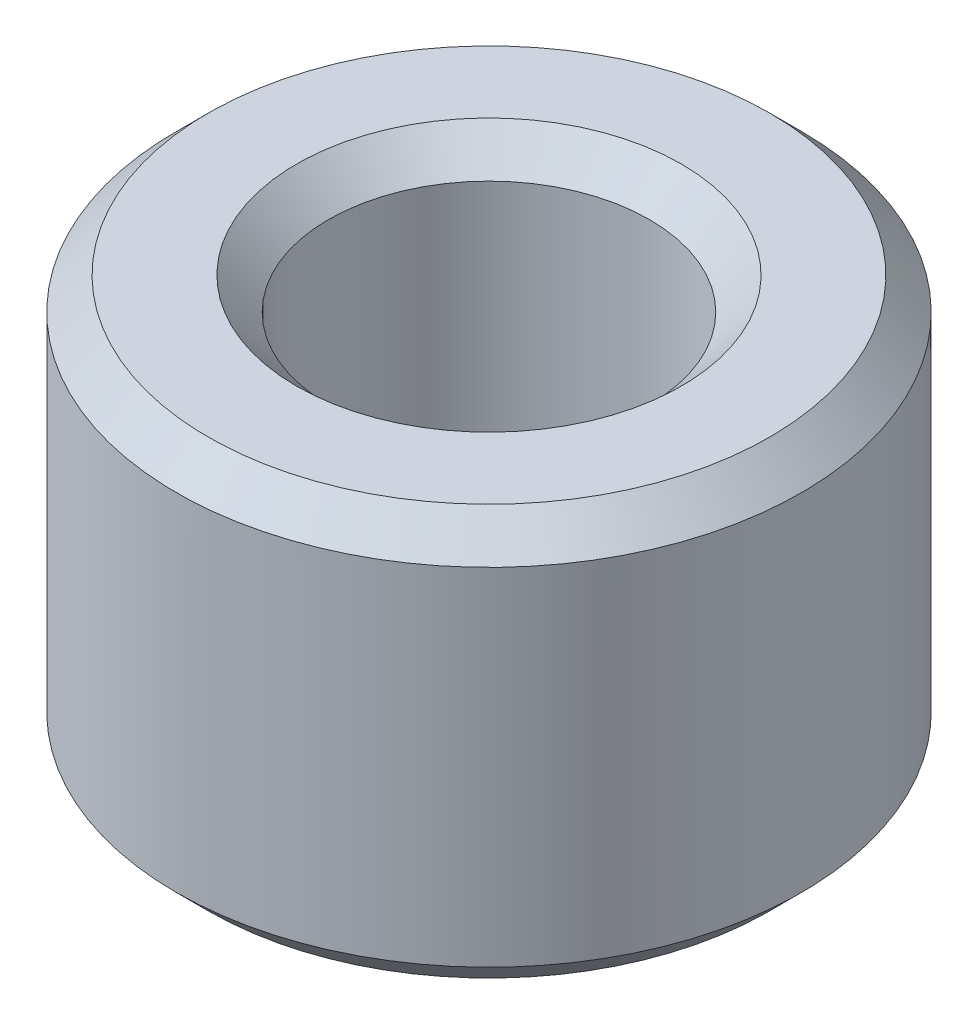
ISO-10303-21;
HEADER;
FILE_DESCRIPTION(('STEP AP214'),'2;1');
FILE_NAME('part.step','',(''),(''),'','','');
FILE_SCHEMA(('AUTOMOTIVE_DESIGN { 1 0 10303 214 1 1 1 1 }'));
ENDSEC;
DATA;
#1=APPLICATION_CONTEXT('core data for automotive mechanical design processes');
#2=APPLICATION_PROTOCOL_DEFINITION('international standard','automotive_design',2000,#1);
#3=PRODUCT_CONTEXT('',#1,'mechanical');
#4=PRODUCT('Part','Part','',(#3));
#5=PRODUCT_RELATED_PRODUCT_CATEGORY('part','',(#4));
#6=PRODUCT_DEFINITION_FORMATION('','',#4);
#7=PRODUCT_DEFINITION_CONTEXT('part definition',#1,'design');
#8=PRODUCT_DEFINITION('design','',#6,#7);
#9=PRODUCT_DEFINITION_SHAPE('','',#8);
#10=(LENGTH_UNIT() NAMED_UNIT(*) SI_UNIT(.MILLI.,.METRE.));
#11=(NAMED_UNIT(*) PLANE_ANGLE_UNIT() SI_UNIT($,.RADIAN.));
#12=(NAMED_UNIT(*) SI_UNIT($,.STERADIAN.) SOLID_ANGLE_UNIT());
#13=UNCERTAINTY_MEASURE_WITH_UNIT(LENGTH_MEASURE(1.E-05),#10,'distance_accuracy_value','');
#14=(GEOMETRIC_REPRESENTATION_CONTEXT(3) GLOBAL_UNCERTAINTY_ASSIGNED_CONTEXT((#13)) GLOBAL_UNIT_ASSIGNED_CONTEXT((#10,
#11,#12)) REPRESENTATION_CONTEXT('',''));
#15=CARTESIAN_POINT('',(0.,0.,0.));
#16=DIRECTION('',(0.,0.,1.));
#17=DIRECTION('',(1.,0.,0.));
#18=AXIS2_PLACEMENT_3D('',#15,#16,#17);
#19=CARTESIAN_POINT('',(0.,42.6467564029163,0.));
#20=DIRECTION('',(0.,-1.,0.));
#21=DIRECTION('',(0.,0.,-1.));
#22=AXIS2_PLACEMENT_3D('',#19,#20,#21);
#23=CYLINDRICAL_SURFACE('',#22,32.5);
#24=CARTESIAN_POINT('',(0.,3.3285684846602,0.));
#25=DIRECTION('',(0.,1.,0.));
#26=DIRECTION('',(0.,0.,1.));
#27=AXIS2_PLACEMENT_3D('',#24,#25,#26);
#28=CIRCLE('',#27,32.5);
#29=CARTESIAN_POINT('',(0.,3.3285684846602,32.5));
#30=VERTEX_POINT('',#29);
#31=EDGE_CURVE('E10',#30,#30,#28,.T.);
#32=ORIENTED_EDGE('',*,*,#31,.T.);
#33=EDGE_LOOP('',(#32));
#34=FACE_BOUND('',#33,.T.);
#35=CARTESIAN_POINT('',(0.,39.318187918256,0.));
#36=DIRECTION('',(0.,1.,0.));
#37=DIRECTION('',(0.,0.,1.));
#38=AXIS2_PLACEMENT_3D('',#35,#36,#37);
#39=CIRCLE('',#38,32.5);
#40=CARTESIAN_POINT('',(0.,39.318187918256,-32.5));
#41=VERTEX_POINT('',#40);
#42=EDGE_CURVE('E50',#41,#41,#39,.F.);
#43=ORIENTED_EDGE('',*,*,#42,.T.);
#44=EDGE_LOOP('',(#43));
#45=FACE_BOUND('',#44,.T.);
#46=ADVANCED_FACE('F39',(#34,#45),#23,.T.);
#47=CARTESIAN_POINT('',(0.,42.6467564029163,0.));
#48=DIRECTION('',(0.,1.,0.));
#49=DIRECTION('',(0.,0.,1.));
#50=AXIS2_PLACEMENT_3D('',#47,#48,#49);
#51=PLANE('',#50);
#52=CARTESIAN_POINT('',(0.,42.6467564029163,0.));
#53=DIRECTION('',(0.,1.,0.));
#54=DIRECTION('',(0.,0.,1.));
#55=AXIS2_PLACEMENT_3D('',#52,#53,#54);
#56=CIRCLE('',#55,19.9974460044769);
#57=CARTESIAN_POINT('',(0.,42.6467564029163,19.9974460044769));
#58=VERTEX_POINT('',#57);
#59=EDGE_CURVE('E58',#58,#58,#56,.F.);
#60=ORIENTED_EDGE('',*,*,#59,.T.);
#61=EDGE_LOOP('',(#60));
#62=FACE_BOUND('',#61,.T.);
#63=CARTESIAN_POINT('',(0.,42.6467564029163,0.));
#64=DIRECTION('',(0.,1.,0.));
#65=DIRECTION('',(0.,0.,1.));
#66=AXIS2_PLACEMENT_3D('',#63,#64,#65);
#67=CIRCLE('',#66,29.1714315153398);
#68=CARTESIAN_POINT('',(0.,42.6467564029163,-29.1714315153398));
#69=VERTEX_POINT('',#68);
#70=EDGE_CURVE('E61',#69,#69,#67,.T.);
#71=ORIENTED_EDGE('',*,*,#70,.T.);
#72=EDGE_LOOP('',(#71));
#73=FACE_BOUND('',#72,.T.);
#74=ADVANCED_FACE('F88',(#62,#73),#51,.T.);
#75=CARTESIAN_POINT('',(0.,0.,0.));
#76=DIRECTION('',(0.,1.,0.));
#77=DIRECTION('',(0.,0.,1.));
#78=AXIS2_PLACEMENT_3D('',#75,#76,#77);
#79=PLANE('',#78);
#80=CARTESIAN_POINT('',(0.,0.,0.));
#81=DIRECTION('',(0.,1.,0.));
#82=DIRECTION('',(0.,0.,1.));
#83=AXIS2_PLACEMENT_3D('',#80,#81,#82);
#84=CIRCLE('',#83,19.9974460044768);
#85=CARTESIAN_POINT('',(0.,0.,-19.9974460044768));
#86=VERTEX_POINT('',#85);
#87=EDGE_CURVE('E51',#86,#86,#84,.T.);
#88=ORIENTED_EDGE('',*,*,#87,.T.);
#89=EDGE_LOOP('',(#88));
#90=FACE_BOUND('',#89,.T.);
#91=CARTESIAN_POINT('',(0.,0.,0.));
#92=DIRECTION('',(0.,1.,0.));
#93=DIRECTION('',(0.,0.,1.));
#94=AXIS2_PLACEMENT_3D('',#91,#92,#93);
#95=CIRCLE('',#94,29.1714315153398);
#96=CARTESIAN_POINT('',(0.,0.,29.1714315153398));
#97=VERTEX_POINT('',#96);
#98=EDGE_CURVE('E54',#97,#97,#95,.F.);
#99=ORIENTED_EDGE('',*,*,#98,.T.);
#100=EDGE_LOOP('',(#99));
#101=FACE_BOUND('',#100,.T.);
#102=ADVANCED_FACE('F83',(#90,#101),#79,.F.);
#103=CARTESIAN_POINT('',(0.,42.6467564029163,0.));
#104=DIRECTION('',(0.,-1.,0.));
#105=DIRECTION('',(0.,0.,-1.));
#106=AXIS2_PLACEMENT_3D('',#103,#104,#105);
#107=CYLINDRICAL_SURFACE('',#106,16.6688775198166);
#108=CARTESIAN_POINT('',(0.,39.3181879182561,0.));
#109=DIRECTION('',(0.,1.,0.));
#110=DIRECTION('',(0.,0.,1.));
#111=AXIS2_PLACEMENT_3D('',#108,#109,#110);
#112=CIRCLE('',#111,16.6688775198166);
#113=CARTESIAN_POINT('',(0.,39.3181879182561,-16.6688775198166));
#114=VERTEX_POINT('',#113);
#115=EDGE_CURVE('E67',#114,#114,#112,.T.);
#116=CARTESIAN_POINT('',(0.,3.32856848466024,0.));
#117=DIRECTION('',(0.,1.,0.));
#118=DIRECTION('',(0.,0.,1.));
#119=AXIS2_PLACEMENT_3D('',#116,#117,#118);
#120=CIRCLE('',#119,16.6688775198166);
#121=CARTESIAN_POINT('',(0.,3.32856848466024,-16.6688775198166));
#122=VERTEX_POINT('',#121);
#123=EDGE_CURVE('E69',#122,#122,#120,.F.);
#124=CARTESIAN_POINT('',(0.,39.3181879182561,-16.6688775198166));
#125=CARTESIAN_POINT('',(0.,38.9432960491561,-16.6688775198166));
#126=CARTESIAN_POINT('',(0.,38.5684041800562,-16.6688775198166));
#127=CARTESIAN_POINT('',(0.,37.8186204418562,-16.6688775198166));
#128=CARTESIAN_POINT('',(0.,37.4437285727563,-16.6688775198166));
#129=CARTESIAN_POINT('',(0.,36.6939448345564,-16.6688775198166));
#130=CARTESIAN_POINT('',(0.,36.3190529654564,-16.6688775198166));
#131=CARTESIAN_POINT('',(0.,35.5692692272565,-16.6688775198166));
#132=CARTESIAN_POINT('',(0.,35.1943773581566,-16.6688775198166));
#133=CARTESIAN_POINT('',(0.,34.4445936199566,-16.6688775198166));
#134=CARTESIAN_POINT('',(0.,34.0697017508567,-16.6688775198166));
#135=CARTESIAN_POINT('',(0.,33.3199180126568,-16.6688775198166));
#136=CARTESIAN_POINT('',(0.,32.9450261435568,-16.6688775198166));
#137=CARTESIAN_POINT('',(0.,32.1952424053569,-16.6688775198166));
#138=CARTESIAN_POINT('',(0.,31.8203505362569,-16.6688775198166));
#139=CARTESIAN_POINT('',(0.,31.070566798057,-16.6688775198166));
#140=CARTESIAN_POINT('',(0.,30.6956749289571,-16.6688775198166));
#141=CARTESIAN_POINT('',(0.,29.9458911907572,-16.6688775198166));
#142=CARTESIAN_POINT('',(0.,29.5709993216572,-16.6688775198166));
#143=CARTESIAN_POINT('',(0.,28.8212155834573,-16.6688775198166));
#144=CARTESIAN_POINT('',(0.,28.4463237143573,-16.6688775198166));
#145=CARTESIAN_POINT('',(0.,27.6965399761574,-16.6688775198166));
#146=CARTESIAN_POINT('',(0.,27.3216481070575,-16.6688775198166));
#147=CARTESIAN_POINT('',(0.,26.5718643688576,-16.6688775198166));
#148=CARTESIAN_POINT('',(0.,26.1969724997576,-16.6688775198166));
#149=CARTESIAN_POINT('',(0.,25.4471887615577,-16.6688775198166));
#150=CARTESIAN_POINT('',(0.,25.0722968924577,-16.6688775198166));
#151=CARTESIAN_POINT('',(0.,24.3225131542578,-16.6688775198166));
#152=CARTESIAN_POINT('',(0.,23.9476212851579,-16.6688775198166));
#153=CARTESIAN_POINT('',(0.,23.1978375469579,-16.6688775198166));
#154=CARTESIAN_POINT('',(0.,22.822945677858,-16.6688775198166));
#155=CARTESIAN_POINT('',(0.,22.0731619396581,-16.6688775198166));
#156=CARTESIAN_POINT('',(0.,21.6982700705581,-16.6688775198166));
#157=CARTESIAN_POINT('',(0.,20.9484863323582,-16.6688775198166));
#158=CARTESIAN_POINT('',(0.,20.5735944632582,-16.6688775198166));
#159=CARTESIAN_POINT('',(0.,19.8238107250583,-16.6688775198166));
#160=CARTESIAN_POINT('',(0.,19.4489188559584,-16.6688775198166));
#161=CARTESIAN_POINT('',(0.,18.6991351177585,-16.6688775198166));
#162=CARTESIAN_POINT('',(0.,18.3242432486585,-16.6688775198166));
#163=CARTESIAN_POINT('',(0.,17.5744595104586,-16.6688775198166));
#164=CARTESIAN_POINT('',(0.,17.1995676413586,-16.6688775198166));
#165=CARTESIAN_POINT('',(0.,16.4497839031587,-16.6688775198166));
#166=CARTESIAN_POINT('',(0.,16.0748920340588,-16.6688775198166));
#167=CARTESIAN_POINT('',(0.,15.3251082958589,-16.6688775198166));
#168=CARTESIAN_POINT('',(0.,14.9502164267589,-16.6688775198166));
#169=CARTESIAN_POINT('',(0.,14.200432688559,-16.6688775198166));
#170=CARTESIAN_POINT('',(0.,13.825540819459,-16.6688775198166));
#171=CARTESIAN_POINT('',(0.,13.0757570812591,-16.6688775198166));
#172=CARTESIAN_POINT('',(0.,12.7008652121592,-16.6688775198166));
#173=CARTESIAN_POINT('',(0.,11.9510814739592,-16.6688775198166));
#174=CARTESIAN_POINT('',(0.,11.5761896048593,-16.6688775198166));
#175=CARTESIAN_POINT('',(0.,10.8264058666594,-16.6688775198166));
#176=CARTESIAN_POINT('',(0.,10.4515139975594,-16.6688775198166));
#177=CARTESIAN_POINT('',(0.,9.7017302593595,-16.6688775198166));
#178=CARTESIAN_POINT('',(0.,9.32683839025954,-16.6688775198166));
#179=CARTESIAN_POINT('',(0.,8.57705465205963,-16.6688775198166));
#180=CARTESIAN_POINT('',(0.,8.20216278295967,-16.6688775198166));
#181=CARTESIAN_POINT('',(0.,7.45237904475976,-16.6688775198166));
#182=CARTESIAN_POINT('',(0.,7.0774871756598,-16.6688775198166));
#183=CARTESIAN_POINT('',(0.,6.32770343745989,-16.6688775198166));
#184=CARTESIAN_POINT('',(0.,5.95281156835993,-16.6688775198166));
#185=CARTESIAN_POINT('',(0.,5.20302783016002,-16.6688775198166));
#186=CARTESIAN_POINT('',(0.,4.82813596106006,-16.6688775198166));
#187=CARTESIAN_POINT('',(0.,4.07835222286015,-16.6688775198166));
#188=CARTESIAN_POINT('',(0.,3.7034603537602,-16.6688775198166));
#189=CARTESIAN_POINT('',(0.,3.32856848466024,-16.6688775198166));
#190=B_SPLINE_CURVE_WITH_KNOTS('',3,(#124,#125,#126,#127,#128,#129,#130,#131,#132,#133,#134,
#135,#136,#137,#138,#139,#140,#141,#142,#143,#144,#145,#146,#147,#148,#149,#150,#151,#152,#153,
#154,#155,#156,#157,#158,#159,#160,#161,#162,#163,#164,#165,#166,#167,#168,#169,#170,#171,#172,
#173,#174,#175,#176,#177,#178,#179,#180,#181,#182,#183,#184,#185,#186,#187,#188,#189),
.UNSPECIFIED.,.F.,.F.,(4,2,2,2,2,2,2,2,2,2,2,2,2,2,2,2,2,2,2,2,2,2,2,2,2,2,2,2,2,2,2,2,4),(0.,
1.12467560729987,2.24935121459974,3.37402682189961,4.49870242919947,5.62337803649934,
6.74805364379921,7.87272925109909,8.99740485839896,10.1220804656988,11.2467560729987,
12.3714316802986,13.4961072875984,14.6207828948983,15.7454585021982,16.870134109498,
17.9948097167979,19.1194853240978,20.2441609313977,21.3688365386975,22.4935121459974,
23.6181877532973,24.7428633605971,25.867538967897,26.9922145751969,28.1168901824967,
29.2415657897966,30.3662413970965,31.4909170043964,32.6155926116962,33.7402682189961,
34.864943826296,35.9896194335958),.UNSPECIFIED.);
#191=EDGE_CURVE('BSEAM71',#114,#122,#190,.T.);
#192=ORIENTED_EDGE('',*,*,#115,.T.);
#193=ORIENTED_EDGE('',*,*,#123,.T.);
#194=ORIENTED_EDGE('',*,*,#191,.T.);
#195=ORIENTED_EDGE('',*,*,#191,.F.);
#196=EDGE_LOOP('',(#192,#194,#193,#195));
#197=FACE_BOUND('',#196,.T.);
#198=ADVANCED_FACE('F71',(#197),#107,.F.);
#199=CARTESIAN_POINT('',(0.,39.3181879182561,0.));
#200=DIRECTION('',(0.,1.,0.));
#201=DIRECTION('',(0.,0.,1.));
#202=AXIS2_PLACEMENT_3D('',#199,#200,#201);
#203=CONICAL_SURFACE('',#202,16.6688775198166,0.785398163397452);
#204=ORIENTED_EDGE('',*,*,#59,.F.);
#205=EDGE_LOOP('',(#204));
#206=FACE_BOUND('',#205,.T.);
#207=ORIENTED_EDGE('',*,*,#115,.F.);
#208=EDGE_LOOP('',(#207));
#209=FACE_BOUND('',#208,.T.);
#210=ADVANCED_FACE('F77',(#206,#209),#203,.F.);
#211=CARTESIAN_POINT('',(0.,0.,0.));
#212=DIRECTION('',(0.,-1.,0.));
#213=DIRECTION('',(0.,0.,-1.));
#214=AXIS2_PLACEMENT_3D('',#211,#212,#213);
#215=CONICAL_SURFACE('',#214,19.9974460044768,0.785398163397445);
#216=CARTESIAN_POINT('',(0.,3.32856848466024,-16.6688775198166));
#217=CARTESIAN_POINT('',(0.,3.29389589627836,-16.7035501081985));
#218=CARTESIAN_POINT('',(0.,3.25922330789648,-16.7382226965803));
#219=CARTESIAN_POINT('',(0.,3.18987813113273,-16.8075678733441));
#220=CARTESIAN_POINT('',(0.,3.15520554275085,-16.842240461726));
#221=CARTESIAN_POINT('',(0.,3.0858603659871,-16.9115856384897));
#222=CARTESIAN_POINT('',(0.,3.05118777760522,-16.9462582268716));
#223=CARTESIAN_POINT('',(0.,2.98184260084146,-17.0156034036354));
#224=CARTESIAN_POINT('',(0.,2.94717001245959,-17.0502759920172));
#225=CARTESIAN_POINT('',(0.,2.87782483569583,-17.119621168781));
#226=CARTESIAN_POINT('',(0.,2.84315224731395,-17.1542937571629));
#227=CARTESIAN_POINT('',(0.,2.7738070705502,-17.2236389339266));
#228=CARTESIAN_POINT('',(0.,2.73913448216832,-17.2583115223085));
#229=CARTESIAN_POINT('',(0.,2.66978930540457,-17.3276566990723));
#230=CARTESIAN_POINT('',(0.,2.63511671702269,-17.3623292874541));
#231=CARTESIAN_POINT('',(0.,2.56577154025893,-17.4316744642179));
#232=CARTESIAN_POINT('',(0.,2.53109895187706,-17.4663470525998));
#233=CARTESIAN_POINT('',(0.,2.4617537751133,-17.5356922293635));
#234=CARTESIAN_POINT('',(0.,2.42708118673142,-17.5703648177454));
#235=CARTESIAN_POINT('',(0.,2.35773600996767,-17.6397099945092));
#236=CARTESIAN_POINT('',(0.,2.32306342158579,-17.674382582891));
#237=CARTESIAN_POINT('',(0.,2.25371824482204,-17.7437277596548));
#238=CARTESIAN_POINT('',(0.,2.21904565644016,-17.7784003480367));
#239=CARTESIAN_POINT('',(0.,2.1497004796764,-17.8477455248004));
#240=CARTESIAN_POINT('',(0.,2.11502789129453,-17.8824181131823));
#241=CARTESIAN_POINT('',(0.,2.04568271453077,-17.951763289946));
#242=CARTESIAN_POINT('',(0.,2.01101012614889,-17.9864358783279));
#243=CARTESIAN_POINT('',(0.,1.94166494938514,-18.0557810550917));
#244=CARTESIAN_POINT('',(0.,1.90699236100326,-18.0904536434736));
#245=CARTESIAN_POINT('',(0.,1.83764718423951,-18.1597988202373));
#246=CARTESIAN_POINT('',(0.,1.80297459585763,-18.1944714086192));
#247=CARTESIAN_POINT('',(0.,1.73362941909387,-18.2638165853829));
#248=CARTESIAN_POINT('',(0.,1.698956830712,-18.2984891737648));
#249=CARTESIAN_POINT('',(0.,1.62961165394824,-18.3678343505286));
#250=CARTESIAN_POINT('',(0.,1.59493906556636,-18.4025069389105));
#251=CARTESIAN_POINT('',(0.,1.52559388880261,-18.4718521156742));
#252=CARTESIAN_POINT('',(0.,1.49092130042073,-18.5065247040561));
#253=CARTESIAN_POINT('',(0.,1.42157612365698,-18.5758698808198));
#254=CARTESIAN_POINT('',(0.,1.3869035352751,-18.6105424692017));
#255=CARTESIAN_POINT('',(0.,1.31755835851134,-18.6798876459655));
#256=CARTESIAN_POINT('',(0.,1.28288577012947,-18.7145602343473));
#257=CARTESIAN_POINT('',(0.,1.21354059336571,-18.7839054111111));
#258=CARTESIAN_POINT('',(0.,1.17886800498383,-18.818577999493));
#259=CARTESIAN_POINT('',(0.,1.10952282822008,-18.8879231762567));
#260=CARTESIAN_POINT('',(0.,1.0748502398382,-18.9225957646386));
#261=CARTESIAN_POINT('',(0.,1.00550506307445,-18.9919409414024));
#262=CARTESIAN_POINT('',(0.,0.97083247469257,-19.0266135297842));
#263=CARTESIAN_POINT('',(0.,0.901487297928815,-19.095958706548));
#264=CARTESIAN_POINT('',(0.,0.866814709546937,-19.1306312949299));
#265=CARTESIAN_POINT('',(0.,0.797469532783182,-19.1999764716936));
#266=CARTESIAN_POINT('',(0.,0.762796944401305,-19.2346490600755));
#267=CARTESIAN_POINT('',(0.,0.69345176763755,-19.3039942368393));
#268=CARTESIAN_POINT('',(0.,0.658779179255672,-19.3386668252211));
#269=CARTESIAN_POINT('',(0.,0.589434002491917,-19.4080120019849));
#270=CARTESIAN_POINT('',(0.,0.55476141411004,-19.4426845903668));
#271=CARTESIAN_POINT('',(0.,0.485416237346285,-19.5120297671305));
#272=CARTESIAN_POINT('',(0.,0.450743648964407,-19.5467023555124));
#273=CARTESIAN_POINT('',(0.,0.381398472200652,-19.6160475322762));
#274=CARTESIAN_POINT('',(0.,0.346725883818775,-19.650720120658));
#275=CARTESIAN_POINT('',(0.,0.27738070705502,-19.7200652974218));
#276=CARTESIAN_POINT('',(0.,0.242708118673143,-19.7547378858037));
#277=CARTESIAN_POINT('',(0.,0.173362941909387,-19.8240830625674));
#278=CARTESIAN_POINT('',(0.,0.13869035352751,-19.8587556509493));
#279=CARTESIAN_POINT('',(0.,0.0693451767637548,-19.9281008277131));
#280=CARTESIAN_POINT('',(0.,0.0346725883818774,-19.9627734160949));
#281=CARTESIAN_POINT('',(0.,0.,-19.9974460044768));
#282=B_SPLINE_CURVE_WITH_KNOTS('',3,(#216,#217,#218,#219,#220,#221,#222,#223,#224,#225,#226,
#227,#228,#229,#230,#231,#232,#233,#234,#235,#236,#237,#238,#239,#240,#241,#242,#243,#244,#245,
#246,#247,#248,#249,#250,#251,#252,#253,#254,#255,#256,#257,#258,#259,#260,#261,#262,#263,#264,
#265,#266,#267,#268,#269,#270,#271,#272,#273,#274,#275,#276,#277,#278,#279,#280,#281),
.UNSPECIFIED.,.F.,.F.,(4,2,2,2,2,2,2,2,2,2,2,2,2,2,2,2,2,2,2,2,2,2,2,2,2,2,2,2,2,2,2,2,4),(0.,
0.147103334196693,0.294206668393385,0.441310002590078,0.588413336786768,0.735516670983461,
0.882620005180154,1.02972333937685,1.17682667357354,1.32393000777023,1.47103334196692,
1.61813667616362,1.76524001036031,1.912343344557,2.05944667875369,2.20655001295039,
2.35365334714708,2.50075668134377,2.64786001554047,2.79496334973716,2.94206668393385,
3.08917001813054,3.23627335232723,3.38337668652393,3.53048002072062,3.67758335491731,
3.824686689114,3.9717900233107,4.11889335750739,4.26599669170408,4.41310002590077,
4.56020336009747,4.70730669429416),.UNSPECIFIED.);
#283=EDGE_CURVE('BSEAM73',#122,#86,#282,.T.);
#284=ORIENTED_EDGE('',*,*,#123,.F.);
#285=ORIENTED_EDGE('',*,*,#87,.F.);
#286=ORIENTED_EDGE('',*,*,#283,.T.);
#287=ORIENTED_EDGE('',*,*,#283,.F.);
#288=EDGE_LOOP('',(#284,#286,#285,#287));
#289=FACE_BOUND('',#288,.T.);
#290=ADVANCED_FACE('F73',(#289),#215,.F.);
#291=CARTESIAN_POINT('',(0.,3.3285684846602,0.));
#292=DIRECTION('',(0.,1.,0.));
#293=DIRECTION('',(0.,0.,1.));
#294=AXIS2_PLACEMENT_3D('',#291,#292,#293);
#295=CONICAL_SURFACE('',#294,32.5,0.785398163397451);
#296=ORIENTED_EDGE('',*,*,#98,.F.);
#297=EDGE_LOOP('',(#296));
#298=FACE_BOUND('',#297,.T.);
#299=ORIENTED_EDGE('',*,*,#31,.F.);
#300=EDGE_LOOP('',(#299));
#301=FACE_BOUND('',#300,.T.);
#302=ADVANCED_FACE('F76',(#298,#301),#295,.T.);
#303=CARTESIAN_POINT('',(0.,42.6467564029163,0.));
#304=DIRECTION('',(0.,-1.,0.));
#305=DIRECTION('',(0.,0.,-1.));
#306=AXIS2_PLACEMENT_3D('',#303,#304,#305);
#307=CONICAL_SURFACE('',#306,29.1714315153398,0.785398163397443);
#308=CARTESIAN_POINT('',(0.,39.318187918256,-32.5));
#309=CARTESIAN_POINT('',(0.,39.3528605066379,-32.4653274116181));
#310=CARTESIAN_POINT('',(0.,39.3875330950198,-32.4306548232363));
#311=CARTESIAN_POINT('',(0.,39.4568782717835,-32.3613096464725));
#312=CARTESIAN_POINT('',(0.,39.4915508601654,-32.3266370580906));
#313=CARTESIAN_POINT('',(0.,39.5608960369292,-32.2572918813269));
#314=CARTESIAN_POINT('',(0.,39.5955686253111,-32.222619292945));
#315=CARTESIAN_POINT('',(0.,39.6649138020748,-32.1532741161812));
#316=CARTESIAN_POINT('',(0.,39.6995863904567,-32.1186015277993));
#317=CARTESIAN_POINT('',(0.,39.7689315672204,-32.0492563510356));
#318=CARTESIAN_POINT('',(0.,39.8036041556023,-32.0145837626537));
#319=CARTESIAN_POINT('',(0.,39.8729493323661,-31.94523858589));
#320=CARTESIAN_POINT('',(0.,39.907621920748,-31.9105659975081));
#321=CARTESIAN_POINT('',(0.,39.9769670975117,-31.8412208207443));
#322=CARTESIAN_POINT('',(0.,40.0116396858936,-31.8065482323625));
#323=CARTESIAN_POINT('',(0.,40.0809848626573,-31.7372030555987));
#324=CARTESIAN_POINT('',(0.,40.1156574510392,-31.7025304672168));
#325=CARTESIAN_POINT('',(0.,40.185002627803,-31.6331852904531));
#326=CARTESIAN_POINT('',(0.,40.2196752161849,-31.5985127020712));
#327=CARTESIAN_POINT('',(0.,40.2890203929486,-31.5291675253074));
#328=CARTESIAN_POINT('',(0.,40.3236929813305,-31.4944949369256));
#329=CARTESIAN_POINT('',(0.,40.3930381580942,-31.4251497601618));
#330=CARTESIAN_POINT('',(0.,40.4277107464761,-31.3904771717799));
#331=CARTESIAN_POINT('',(0.,40.4970559232399,-31.3211319950162));
#332=CARTESIAN_POINT('',(0.,40.5317285116218,-31.2864594066343));
#333=CARTESIAN_POINT('',(0.,40.6010736883855,-31.2171142298705));
#334=CARTESIAN_POINT('',(0.,40.6357462767674,-31.1824416414887));
#335=CARTESIAN_POINT('',(0.,40.7050914535311,-31.1130964647249));
#336=CARTESIAN_POINT('',(0.,40.739764041913,-31.078423876343));
#337=CARTESIAN_POINT('',(0.,40.8091092186768,-31.0090786995793));
#338=CARTESIAN_POINT('',(0.,40.8437818070587,-30.9744061111974));
#339=CARTESIAN_POINT('',(0.,40.9131269838224,-30.9050609344336));
#340=CARTESIAN_POINT('',(0.,40.9477995722043,-30.8703883460518));
#341=CARTESIAN_POINT('',(0.,41.017144748968,-30.801043169288));
#342=CARTESIAN_POINT('',(0.,41.0518173373499,-30.7663705809061));
#343=CARTESIAN_POINT('',(0.,41.1211625141137,-30.6970254041424));
#344=CARTESIAN_POINT('',(0.,41.1558351024956,-30.6623528157605));
#345=CARTESIAN_POINT('',(0.,41.2251802792593,-30.5930076389967));
#346=CARTESIAN_POINT('',(0.,41.2598528676412,-30.5583350506149));
#347=CARTESIAN_POINT('',(0.,41.3291980444049,-30.4889898738511));
#348=CARTESIAN_POINT('',(0.,41.3638706327868,-30.4543172854692));
#349=CARTESIAN_POINT('',(0.,41.4332158095506,-30.3849721087055));
#350=CARTESIAN_POINT('',(0.,41.4678883979325,-30.3502995203236));
#351=CARTESIAN_POINT('',(0.,41.5372335746962,-30.2809543435598));
#352=CARTESIAN_POINT('',(0.,41.5719061630781,-30.246281755178));
#353=CARTESIAN_POINT('',(0.,41.6412513398418,-30.1769365784142));
#354=CARTESIAN_POINT('',(0.,41.6759239282237,-30.1422639900323));
#355=CARTESIAN_POINT('',(0.,41.7452691049875,-30.0729188132686));
#356=CARTESIAN_POINT('',(0.,41.7799416933694,-30.0382462248867));
#357=CARTESIAN_POINT('',(0.,41.8492868701331,-29.9689010481229));
#358=CARTESIAN_POINT('',(0.,41.883959458515,-29.9342284597411));
#359=CARTESIAN_POINT('',(0.,41.9533046352787,-29.8648832829773));
#360=CARTESIAN_POINT('',(0.,41.9879772236606,-29.8302106945954));
#361=CARTESIAN_POINT('',(0.,42.0573224004244,-29.7608655178317));
#362=CARTESIAN_POINT('',(0.,42.0919949888063,-29.7261929294498));
#363=CARTESIAN_POINT('',(0.,42.16134016557,-29.656847752686));
#364=CARTESIAN_POINT('',(0.,42.1960127539519,-29.6221751643042));
#365=CARTESIAN_POINT('',(0.,42.2653579307157,-29.5528299875404));
#366=CARTESIAN_POINT('',(0.,42.3000305190975,-29.5181573991585));
#367=CARTESIAN_POINT('',(0.,42.3693756958613,-29.4488122223948));
#368=CARTESIAN_POINT('',(0.,42.4040482842432,-29.4141396340129));
#369=CARTESIAN_POINT('',(0.,42.4733934610069,-29.3447944572491));
#370=CARTESIAN_POINT('',(0.,42.5080660493888,-29.3101218688673));
#371=CARTESIAN_POINT('',(0.,42.5774112261525,-29.2407766921035));
#372=CARTESIAN_POINT('',(0.,42.6120838145344,-29.2061041037216));
#373=CARTESIAN_POINT('',(0.,42.6467564029163,-29.1714315153398));
#374=B_SPLINE_CURVE_WITH_KNOTS('',3,(#308,#309,#310,#311,#312,#313,#314,#315,#316,#317,#318,
#319,#320,#321,#322,#323,#324,#325,#326,#327,#328,#329,#330,#331,#332,#333,#334,#335,#336,#337,
#338,#339,#340,#341,#342,#343,#344,#345,#346,#347,#348,#349,#350,#351,#352,#353,#354,#355,#356,
#357,#358,#359,#360,#361,#362,#363,#364,#365,#366,#367,#368,#369,#370,#371,#372,#373),
.UNSPECIFIED.,.F.,.F.,(4,2,2,2,2,2,2,2,2,2,2,2,2,2,2,2,2,2,2,2,2,2,2,2,2,2,2,2,2,2,2,2,4),(0.,
0.147103334196697,0.29420666839339,0.441310002590088,0.58841333678678,0.735516670983478,
0.88262000518017,1.02972333937686,1.17682667357356,1.32393000777025,1.47103334196695,
1.61813667616364,1.76524001036033,1.91234334455702,2.05944667875372,2.20655001295042,
2.35365334714711,2.5007566813438,2.64786001554049,2.79496334973719,2.94206668393388,
3.08917001813058,3.23627335232727,3.38337668652397,3.53048002072066,3.67758335491735,
3.82468668911405,3.97179002331074,4.11889335750744,4.26599669170413,4.41310002590082,
4.56020336009752,4.70730669429421),.UNSPECIFIED.);
#375=EDGE_CURVE('BSEAM45',#41,#69,#374,.T.);
#376=ORIENTED_EDGE('',*,*,#42,.F.);
#377=ORIENTED_EDGE('',*,*,#70,.F.);
#378=ORIENTED_EDGE('',*,*,#375,.T.);
#379=ORIENTED_EDGE('',*,*,#375,.F.);
#380=EDGE_LOOP('',(#376,#378,#377,#379));
#381=FACE_BOUND('',#380,.T.);
#382=ADVANCED_FACE('F45',(#381),#307,.T.);
#383=CLOSED_SHELL('',(#46,#74,#102,#198,#210,#290,#302,#382));
#384=MANIFOLD_SOLID_BREP('B2',#383);
#385=ADVANCED_BREP_SHAPE_REPRESENTATION('',(#18,#384),#14);
#386=SHAPE_DEFINITION_REPRESENTATION(#9,#385);
ENDSEC;
END-ISO-10303-21;
